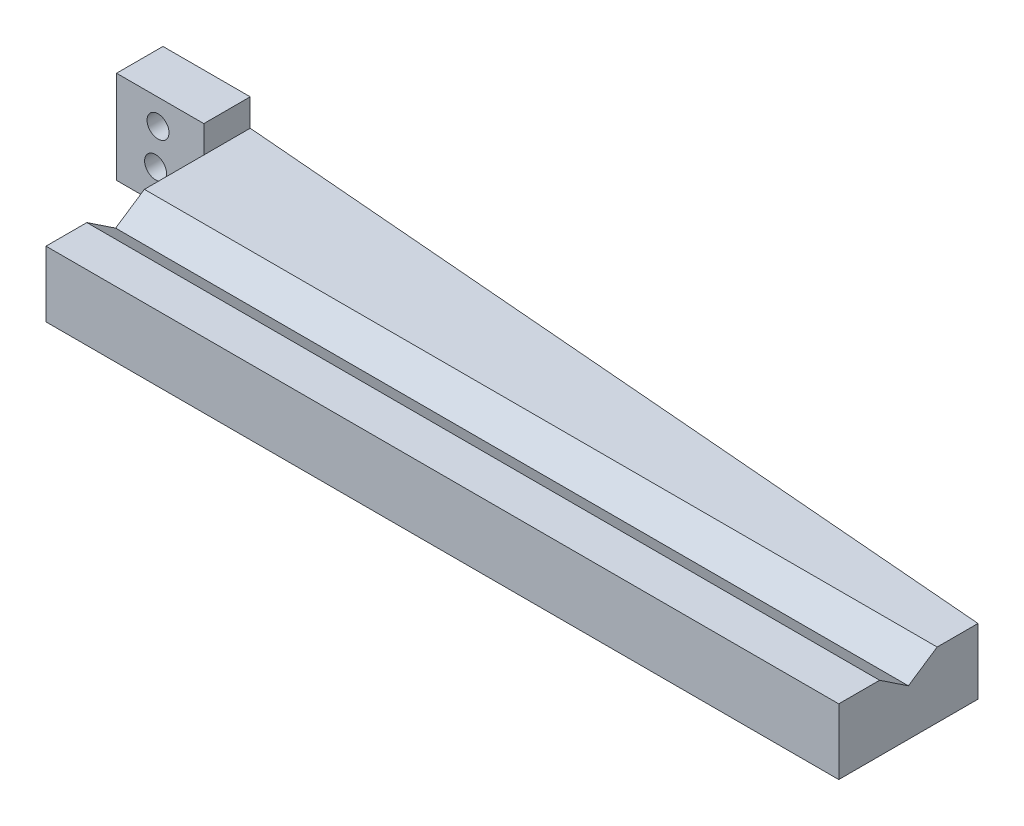
ISO-10303-21;
HEADER;
FILE_DESCRIPTION(('STEP AP214'),'2;1');
FILE_NAME('part.step','',(''),(''),'','','');
FILE_SCHEMA(('AUTOMOTIVE_DESIGN { 1 0 10303 214 1 1 1 1 }'));
ENDSEC;
DATA;
#1=APPLICATION_CONTEXT('core data for automotive mechanical design processes');
#2=APPLICATION_PROTOCOL_DEFINITION('international standard','automotive_design',2000,#1);
#3=PRODUCT_CONTEXT('',#1,'mechanical');
#4=PRODUCT('Part','Part','',(#3));
#5=PRODUCT_RELATED_PRODUCT_CATEGORY('part','',(#4));
#6=PRODUCT_DEFINITION_FORMATION('','',#4);
#7=PRODUCT_DEFINITION_CONTEXT('part definition',#1,'design');
#8=PRODUCT_DEFINITION('design','',#6,#7);
#9=PRODUCT_DEFINITION_SHAPE('','',#8);
#10=(LENGTH_UNIT() NAMED_UNIT(*) SI_UNIT(.MILLI.,.METRE.));
#11=(NAMED_UNIT(*) PLANE_ANGLE_UNIT() SI_UNIT($,.RADIAN.));
#12=(NAMED_UNIT(*) SI_UNIT($,.STERADIAN.) SOLID_ANGLE_UNIT());
#13=UNCERTAINTY_MEASURE_WITH_UNIT(LENGTH_MEASURE(1.E-05),#10,'distance_accuracy_value','');
#14=(GEOMETRIC_REPRESENTATION_CONTEXT(3) GLOBAL_UNCERTAINTY_ASSIGNED_CONTEXT((#13)) GLOBAL_UNIT_ASSIGNED_CONTEXT((#10,
#11,#12)) REPRESENTATION_CONTEXT('',''));
#15=CARTESIAN_POINT('',(0.,0.,0.));
#16=DIRECTION('',(0.,0.,1.));
#17=DIRECTION('',(1.,0.,0.));
#18=AXIS2_PLACEMENT_3D('',#15,#16,#17);
#19=CARTESIAN_POINT('',(0.,6.35,0.));
#20=DIRECTION('',(-1.,0.,0.));
#21=DIRECTION('',(0.,0.,1.));
#22=AXIS2_PLACEMENT_3D('',#19,#20,#21);
#23=PLANE('',#22);
#24=DIRECTION('',(0.,1.,0.));
#25=VECTOR('',#24,1.);
#26=CARTESIAN_POINT('',(0.,12.7,-19.05));
#27=LINE('',#26,#25);
#28=CARTESIAN_POINT('',(0.,0.,-19.05));
#29=VERTEX_POINT('',#28);
#30=CARTESIAN_POINT('',(0.,8.97465996451613,-19.05));
#31=VERTEX_POINT('',#30);
#32=EDGE_CURVE('E131',#29,#31,#27,.T.);
#33=ORIENTED_EDGE('',*,*,#32,.T.);
#34=DIRECTION('',(0.,0.,1.));
#35=VECTOR('',#34,1.);
#36=CARTESIAN_POINT('',(0.,8.97465996451614,0.));
#37=LINE('',#36,#35);
#38=CARTESIAN_POINT('',(0.,8.97465996451619,-13.462));
#39=VERTEX_POINT('',#38);
#40=EDGE_CURVE('E180',#31,#39,#37,.T.);
#41=ORIENTED_EDGE('',*,*,#40,.T.);
#42=DIRECTION('',(0.,-0.554699215611407,0.832050948079557));
#43=VECTOR('',#42,1.);
#44=CARTESIAN_POINT('',(0.,1.12257040558346E-05,7.48378358891833E-06));
#45=LINE('',#44,#43);
#46=CARTESIAN_POINT('',(0.,6.35,-9.52499999999991));
#47=VERTEX_POINT('',#46);
#48=EDGE_CURVE('E185',#39,#47,#45,.T.);
#49=ORIENTED_EDGE('',*,*,#48,.T.);
#50=DIRECTION('',(0.,0.554699215611407,0.832050948079557));
#51=VECTOR('',#50,1.);
#52=CARTESIAN_POINT('',(0.,8.79231028283709,-5.86152522097183));
#53=LINE('',#52,#51);
#54=CARTESIAN_POINT('',(0.,8.97465996451614,-5.58799999999991));
#55=VERTEX_POINT('',#54);
#56=EDGE_CURVE('E189',#47,#55,#53,.T.);
#57=ORIENTED_EDGE('',*,*,#56,.T.);
#58=DIRECTION('',(0.,0.,-1.));
#59=VECTOR('',#58,1.);
#60=CARTESIAN_POINT('',(0.,8.97465996451614,0.));
#61=LINE('',#60,#59);
#62=CARTESIAN_POINT('',(0.,8.97465996451614,0.));
#63=VERTEX_POINT('',#62);
#64=EDGE_CURVE('E193',#63,#55,#61,.T.);
#65=ORIENTED_EDGE('',*,*,#64,.F.);
#66=DIRECTION('',(0.,-1.,0.));
#67=VECTOR('',#66,1.);
#68=CARTESIAN_POINT('',(0.,6.35,0.));
#69=LINE('',#68,#67);
#70=CARTESIAN_POINT('',(0.,0.,0.));
#71=VERTEX_POINT('',#70);
#72=EDGE_CURVE('E11',#63,#71,#69,.T.);
#73=ORIENTED_EDGE('',*,*,#72,.T.);
#74=DIRECTION('',(0.,0.,-1.));
#75=VECTOR('',#74,1.);
#76=CARTESIAN_POINT('',(0.,0.,0.));
#77=LINE('',#76,#75);
#78=EDGE_CURVE('E216',#71,#29,#77,.T.);
#79=ORIENTED_EDGE('',*,*,#78,.T.);
#80=EDGE_LOOP('',(#33,#41,#49,#57,#65,#73,#79));
#81=FACE_BOUND('',#80,.T.);
#82=ADVANCED_FACE('F38',(#81),#23,.F.);
#83=CARTESIAN_POINT('',(-108.458,6.35,-19.05));
#84=DIRECTION('',(1.,0.,0.));
#85=DIRECTION('',(0.,0.,-1.));
#86=AXIS2_PLACEMENT_3D('',#83,#84,#85);
#87=PLANE('',#86);
#88=DIRECTION('',(0.,0.,-1.));
#89=VECTOR('',#88,1.);
#90=CARTESIAN_POINT('',(-108.458,8.97465996451614,0.));
#91=LINE('',#90,#89);
#92=CARTESIAN_POINT('',(-108.458,8.97465996451614,-13.4619999999999));
#93=VERTEX_POINT('',#92);
#94=CARTESIAN_POINT('',(-108.458,8.97465996451613,-21.59));
#95=VERTEX_POINT('',#94);
#96=EDGE_CURVE('E176',#93,#95,#91,.T.);
#97=ORIENTED_EDGE('',*,*,#96,.T.);
#98=DIRECTION('',(0.,-1.,0.));
#99=VECTOR('',#98,1.);
#100=CARTESIAN_POINT('',(-108.458,133.621589231799,-21.59));
#101=LINE('',#100,#99);
#102=CARTESIAN_POINT('',(-108.458,0.,-21.59));
#103=VERTEX_POINT('',#102);
#104=EDGE_CURVE('E168',#95,#103,#101,.T.);
#105=ORIENTED_EDGE('',*,*,#104,.T.);
#106=DIRECTION('',(0.,0.,1.));
#107=VECTOR('',#106,1.);
#108=CARTESIAN_POINT('',(-108.458,0.,-19.05));
#109=LINE('',#108,#107);
#110=CARTESIAN_POINT('',(-108.458,0.,0.));
#111=VERTEX_POINT('',#110);
#112=EDGE_CURVE('E219',#103,#111,#109,.T.);
#113=ORIENTED_EDGE('',*,*,#112,.T.);
#114=DIRECTION('',(0.,-1.,0.));
#115=VECTOR('',#114,1.);
#116=CARTESIAN_POINT('',(-108.458,6.35,0.));
#117=LINE('',#116,#115);
#118=CARTESIAN_POINT('',(-108.458,8.97465996451614,0.));
#119=VERTEX_POINT('',#118);
#120=EDGE_CURVE('E47',#119,#111,#117,.T.);
#121=ORIENTED_EDGE('',*,*,#120,.F.);
#122=DIRECTION('',(0.,0.,1.));
#123=VECTOR('',#122,1.);
#124=CARTESIAN_POINT('',(-108.458,8.97465996451614,0.));
#125=LINE('',#124,#123);
#126=CARTESIAN_POINT('',(-108.458,8.97465996451614,-5.58799999999999));
#127=VERTEX_POINT('',#126);
#128=EDGE_CURVE('E188',#127,#119,#125,.T.);
#129=ORIENTED_EDGE('',*,*,#128,.F.);
#130=DIRECTION('',(0.,-0.554699215611407,-0.832050948079557));
#131=VECTOR('',#130,1.);
#132=CARTESIAN_POINT('',(-108.458,8.79231028283709,-5.86152522097191));
#133=LINE('',#132,#131);
#134=CARTESIAN_POINT('',(-108.458,6.35,-9.52499999999999));
#135=VERTEX_POINT('',#134);
#136=EDGE_CURVE('E197',#127,#135,#133,.T.);
#137=ORIENTED_EDGE('',*,*,#136,.T.);
#138=DIRECTION('',(0.,0.554699215611407,-0.832050948079557));
#139=VECTOR('',#138,1.);
#140=CARTESIAN_POINT('',(-108.458,1.12257040591566E-05,7.48378350492456E-06));
#141=LINE('',#140,#139);
#142=EDGE_CURVE('E177',#135,#93,#141,.T.);
#143=ORIENTED_EDGE('',*,*,#142,.T.);
#144=EDGE_LOOP('',(#97,#105,#113,#121,#129,#137,#143));
#145=FACE_BOUND('',#144,.T.);
#146=ADVANCED_FACE('F225',(#145),#87,.F.);
#147=CARTESIAN_POINT('',(-108.458,133.621589231799,-27.94));
#148=DIRECTION('',(0.0816932394452719,0.,-0.996657521232312));
#149=DIRECTION('',(-0.996657521232313,0.,-0.081693239445272));
#150=AXIS2_PLACEMENT_3D('',#147,#148,#149);
#151=PLANE('',#150);
#152=DIRECTION('',(0.,-1.,0.));
#153=VECTOR('',#152,1.);
#154=CARTESIAN_POINT('',(-108.458,133.621589231799,-27.94));
#155=LINE('',#154,#153);
#156=CARTESIAN_POINT('',(-108.458,8.97465996451613,-27.94));
#157=VERTEX_POINT('',#156);
#158=CARTESIAN_POINT('',(-108.458,0.,-27.94));
#159=VERTEX_POINT('',#158);
#160=EDGE_CURVE('E132',#157,#159,#155,.T.);
#161=ORIENTED_EDGE('',*,*,#160,.F.);
#162=DIRECTION('',(0.996657521232313,0.,0.081693239445272));
#163=VECTOR('',#162,1.);
#164=CARTESIAN_POINT('',(0.,8.97465996451613,-19.05));
#165=LINE('',#164,#163);
#166=EDGE_CURVE('E142',#157,#31,#165,.T.);
#167=ORIENTED_EDGE('',*,*,#166,.T.);
#168=ORIENTED_EDGE('',*,*,#32,.F.);
#169=DIRECTION('',(0.996657521232313,0.,0.081693239445272));
#170=VECTOR('',#169,1.);
#171=CARTESIAN_POINT('',(-108.458,0.,-27.94));
#172=LINE('',#171,#170);
#173=EDGE_CURVE('E257',#159,#29,#172,.T.);
#174=ORIENTED_EDGE('',*,*,#173,.F.);
#175=EDGE_LOOP('',(#161,#167,#168,#174));
#176=FACE_BOUND('',#175,.T.);
#177=ADVANCED_FACE('F293',(#176),#151,.T.);
#178=CARTESIAN_POINT('',(-108.458,6.35,0.));
#179=DIRECTION('',(0.,0.,-1.));
#180=DIRECTION('',(-1.,0.,0.));
#181=AXIS2_PLACEMENT_3D('',#178,#179,#180);
#182=PLANE('',#181);
#183=ORIENTED_EDGE('',*,*,#120,.T.);
#184=DIRECTION('',(1.,0.,0.));
#185=VECTOR('',#184,1.);
#186=CARTESIAN_POINT('',(-108.458,0.,0.));
#187=LINE('',#186,#185);
#188=EDGE_CURVE('E192',#111,#71,#187,.T.);
#189=ORIENTED_EDGE('',*,*,#188,.T.);
#190=ORIENTED_EDGE('',*,*,#72,.F.);
#191=DIRECTION('',(-1.,0.,0.));
#192=VECTOR('',#191,1.);
#193=CARTESIAN_POINT('',(9.88000328589692,8.97465996451614,0.));
#194=LINE('',#193,#192);
#195=EDGE_CURVE('E201',#63,#119,#194,.T.);
#196=ORIENTED_EDGE('',*,*,#195,.T.);
#197=EDGE_LOOP('',(#183,#189,#190,#196));
#198=FACE_BOUND('',#197,.T.);
#199=ADVANCED_FACE('F40',(#198),#182,.F.);
#200=CARTESIAN_POINT('',(0.,0.,0.));
#201=DIRECTION('',(0.,1.,0.));
#202=DIRECTION('',(0.,0.,1.));
#203=AXIS2_PLACEMENT_3D('',#200,#201,#202);
#204=PLANE('',#203);
#205=ORIENTED_EDGE('',*,*,#112,.F.);
#206=DIRECTION('',(-1.,0.,0.));
#207=VECTOR('',#206,1.);
#208=CARTESIAN_POINT('',(-120.396,0.,-21.59));
#209=LINE('',#208,#207);
#210=CARTESIAN_POINT('',(-120.396,0.,-21.59));
#211=VERTEX_POINT('',#210);
#212=EDGE_CURVE('E156',#103,#211,#209,.T.);
#213=ORIENTED_EDGE('',*,*,#212,.T.);
#214=DIRECTION('',(0.,0.,-1.));
#215=VECTOR('',#214,1.);
#216=CARTESIAN_POINT('',(-120.396,0.,-27.94));
#217=LINE('',#216,#215);
#218=CARTESIAN_POINT('',(-120.396,0.,-27.94));
#219=VERTEX_POINT('',#218);
#220=EDGE_CURVE('E264',#211,#219,#217,.T.);
#221=ORIENTED_EDGE('',*,*,#220,.T.);
#222=DIRECTION('',(1.,0.,0.));
#223=VECTOR('',#222,1.);
#224=CARTESIAN_POINT('',(-108.458,0.,-27.94));
#225=LINE('',#224,#223);
#226=EDGE_CURVE('E259',#219,#159,#225,.T.);
#227=ORIENTED_EDGE('',*,*,#226,.T.);
#228=ORIENTED_EDGE('',*,*,#173,.T.);
#229=ORIENTED_EDGE('',*,*,#78,.F.);
#230=ORIENTED_EDGE('',*,*,#188,.F.);
#231=EDGE_LOOP('',(#205,#213,#221,#227,#228,#229,#230));
#232=FACE_BOUND('',#231,.T.);
#233=ADVANCED_FACE('F231',(#232),#204,.F.);
#234=CARTESIAN_POINT('',(9.88000328589692,8.97465996451614,0.));
#235=DIRECTION('',(0.,-1.,0.));
#236=DIRECTION('',(0.,0.,-1.));
#237=AXIS2_PLACEMENT_3D('',#234,#235,#236);
#238=PLANE('',#237);
#239=ORIENTED_EDGE('',*,*,#195,.F.);
#240=ORIENTED_EDGE('',*,*,#64,.T.);
#241=DIRECTION('',(-1.,0.,0.));
#242=VECTOR('',#241,1.);
#243=CARTESIAN_POINT('',(9.88000328589692,8.97465996451614,-5.58799999999991));
#244=LINE('',#243,#242);
#245=EDGE_CURVE('E206',#55,#127,#244,.T.);
#246=ORIENTED_EDGE('',*,*,#245,.T.);
#247=ORIENTED_EDGE('',*,*,#128,.T.);
#248=EDGE_LOOP('',(#239,#240,#246,#247));
#249=FACE_BOUND('',#248,.T.);
#250=ADVANCED_FACE('F237',(#249),#238,.F.);
#251=CARTESIAN_POINT('',(9.88000328589692,8.79231028283709,-5.86152522097182));
#252=DIRECTION('',(0.,0.832050948079557,-0.554699215611407));
#253=DIRECTION('',(0.,0.554699215611407,0.832050948079557));
#254=AXIS2_PLACEMENT_3D('',#251,#252,#253);
#255=PLANE('',#254);
#256=ORIENTED_EDGE('',*,*,#56,.F.);
#257=DIRECTION('',(-1.,0.,0.));
#258=VECTOR('',#257,1.);
#259=CARTESIAN_POINT('',(9.88000328589693,6.35,-9.52499999999991));
#260=LINE('',#259,#258);
#261=EDGE_CURVE('E202',#47,#135,#260,.T.);
#262=ORIENTED_EDGE('',*,*,#261,.T.);
#263=ORIENTED_EDGE('',*,*,#136,.F.);
#264=ORIENTED_EDGE('',*,*,#245,.F.);
#265=EDGE_LOOP('',(#256,#262,#263,#264));
#266=FACE_BOUND('',#265,.T.);
#267=ADVANCED_FACE('F240',(#266),#255,.T.);
#268=CARTESIAN_POINT('',(9.88000328589692,8.97465996451614,0.));
#269=DIRECTION('',(0.,1.,0.));
#270=DIRECTION('',(0.,0.,1.));
#271=AXIS2_PLACEMENT_3D('',#268,#269,#270);
#272=PLANE('',#271);
#273=ORIENTED_EDGE('',*,*,#40,.F.);
#274=ORIENTED_EDGE('',*,*,#166,.F.);
#275=DIRECTION('',(0.,0.,-1.));
#276=VECTOR('',#275,1.);
#277=CARTESIAN_POINT('',(-108.458,8.97465996451613,-27.94));
#278=LINE('',#277,#276);
#279=EDGE_CURVE('E126',#95,#157,#278,.T.);
#280=ORIENTED_EDGE('',*,*,#279,.F.);
#281=ORIENTED_EDGE('',*,*,#96,.F.);
#282=DIRECTION('',(-1.,0.,0.));
#283=VECTOR('',#282,1.);
#284=CARTESIAN_POINT('',(9.88000328589693,8.97465996451614,-13.4619999999999));
#285=LINE('',#284,#283);
#286=EDGE_CURVE('E172',#39,#93,#285,.T.);
#287=ORIENTED_EDGE('',*,*,#286,.F.);
#288=EDGE_LOOP('',(#273,#274,#280,#281,#287));
#289=FACE_BOUND('',#288,.T.);
#290=ADVANCED_FACE('F249',(#289),#272,.T.);
#291=CARTESIAN_POINT('',(9.88000328589692,1.12257040591566E-05,7.48378359113294E-06));
#292=DIRECTION('',(0.,0.832050948079557,0.554699215611407));
#293=DIRECTION('',(0.,-0.554699215611407,0.832050948079557));
#294=AXIS2_PLACEMENT_3D('',#291,#292,#293);
#295=PLANE('',#294);
#296=ORIENTED_EDGE('',*,*,#48,.F.);
#297=ORIENTED_EDGE('',*,*,#286,.T.);
#298=ORIENTED_EDGE('',*,*,#142,.F.);
#299=ORIENTED_EDGE('',*,*,#261,.F.);
#300=EDGE_LOOP('',(#296,#297,#298,#299));
#301=FACE_BOUND('',#300,.T.);
#302=ADVANCED_FACE('F244',(#301),#295,.T.);
#303=CARTESIAN_POINT('',(-108.458,12.7,0.));
#304=DIRECTION('',(0.,1.,0.));
#305=DIRECTION('',(0.,0.,1.));
#306=AXIS2_PLACEMENT_3D('',#303,#304,#305);
#307=PLANE('',#306);
#308=DIRECTION('',(0.,0.,1.));
#309=VECTOR('',#308,1.);
#310=CARTESIAN_POINT('',(-108.458,12.7,-27.94));
#311=LINE('',#310,#309);
#312=CARTESIAN_POINT('',(-108.458,12.7,-27.94));
#313=VERTEX_POINT('',#312);
#314=CARTESIAN_POINT('',(-108.458,12.7,-21.59));
#315=VERTEX_POINT('',#314);
#316=EDGE_CURVE('E123',#313,#315,#311,.T.);
#317=ORIENTED_EDGE('',*,*,#316,.F.);
#318=DIRECTION('',(1.,0.,0.));
#319=VECTOR('',#318,1.);
#320=CARTESIAN_POINT('',(-108.458,12.7,-27.94));
#321=LINE('',#320,#319);
#322=CARTESIAN_POINT('',(-120.396,12.7,-27.94));
#323=VERTEX_POINT('',#322);
#324=EDGE_CURVE('E136',#323,#313,#321,.T.);
#325=ORIENTED_EDGE('',*,*,#324,.F.);
#326=DIRECTION('',(0.,0.,-1.));
#327=VECTOR('',#326,1.);
#328=CARTESIAN_POINT('',(-120.396,12.7,-27.94));
#329=LINE('',#328,#327);
#330=CARTESIAN_POINT('',(-120.396,12.7,-21.59));
#331=VERTEX_POINT('',#330);
#332=EDGE_CURVE('E152',#331,#323,#329,.T.);
#333=ORIENTED_EDGE('',*,*,#332,.F.);
#334=DIRECTION('',(-1.,0.,0.));
#335=VECTOR('',#334,1.);
#336=CARTESIAN_POINT('',(-120.396,12.7,-21.59));
#337=LINE('',#336,#335);
#338=EDGE_CURVE('E139',#315,#331,#337,.T.);
#339=ORIENTED_EDGE('',*,*,#338,.F.);
#340=EDGE_LOOP('',(#317,#325,#333,#339));
#341=FACE_BOUND('',#340,.T.);
#342=ADVANCED_FACE('F135',(#341),#307,.T.);
#343=CARTESIAN_POINT('',(-120.396,133.621589231799,-21.59));
#344=DIRECTION('',(0.,0.,1.));
#345=DIRECTION('',(1.,0.,0.));
#346=AXIS2_PLACEMENT_3D('',#343,#344,#345);
#347=PLANE('',#346);
#348=CARTESIAN_POINT('',(-114.72155051271,9.23479964939844,-21.59));
#349=DIRECTION('',(0.,0.,1.));
#350=DIRECTION('',(1.,0.,0.));
#351=AXIS2_PLACEMENT_3D('',#348,#349,#350);
#352=CIRCLE('',#351,1.5);
#353=CARTESIAN_POINT('',(-113.22155051271,9.23479964939844,-21.59));
#354=VERTEX_POINT('',#353);
#355=EDGE_CURVE('E267',#354,#354,#352,.T.);
#356=ORIENTED_EDGE('',*,*,#355,.F.);
#357=EDGE_LOOP('',(#356));
#358=FACE_BOUND('',#357,.T.);
#359=CARTESIAN_POINT('',(-115.057652976821,4.23728899252751,-21.59));
#360=DIRECTION('',(0.,0.,1.));
#361=DIRECTION('',(1.,0.,0.));
#362=AXIS2_PLACEMENT_3D('',#359,#360,#361);
#363=CIRCLE('',#362,1.5);
#364=CARTESIAN_POINT('',(-113.557652976821,4.23728899252751,-21.59));
#365=VERTEX_POINT('',#364);
#366=EDGE_CURVE('E275',#365,#365,#363,.T.);
#367=ORIENTED_EDGE('',*,*,#366,.F.);
#368=EDGE_LOOP('',(#367));
#369=FACE_BOUND('',#368,.T.);
#370=EDGE_CURVE('E162',#315,#95,#101,.T.);
#371=ORIENTED_EDGE('',*,*,#370,.F.);
#372=ORIENTED_EDGE('',*,*,#338,.T.);
#373=DIRECTION('',(0.,-1.,0.));
#374=VECTOR('',#373,1.);
#375=CARTESIAN_POINT('',(-120.396,133.621589231799,-21.59));
#376=LINE('',#375,#374);
#377=EDGE_CURVE('E160',#331,#211,#376,.T.);
#378=ORIENTED_EDGE('',*,*,#377,.T.);
#379=ORIENTED_EDGE('',*,*,#212,.F.);
#380=ORIENTED_EDGE('',*,*,#104,.F.);
#381=EDGE_LOOP('',(#371,#372,#378,#379,#380));
#382=FACE_BOUND('',#381,.T.);
#383=ADVANCED_FACE('F255',(#358,#369,#382),#347,.T.);
#384=CARTESIAN_POINT('',(-120.396,133.621589231799,-27.94));
#385=DIRECTION('',(-1.,0.,0.));
#386=DIRECTION('',(0.,0.,1.));
#387=AXIS2_PLACEMENT_3D('',#384,#385,#386);
#388=PLANE('',#387);
#389=ORIENTED_EDGE('',*,*,#377,.F.);
#390=ORIENTED_EDGE('',*,*,#332,.T.);
#391=DIRECTION('',(0.,-1.,0.));
#392=VECTOR('',#391,1.);
#393=CARTESIAN_POINT('',(-120.396,133.621589231799,-27.94));
#394=LINE('',#393,#392);
#395=EDGE_CURVE('E146',#323,#219,#394,.T.);
#396=ORIENTED_EDGE('',*,*,#395,.T.);
#397=ORIENTED_EDGE('',*,*,#220,.F.);
#398=EDGE_LOOP('',(#389,#390,#396,#397));
#399=FACE_BOUND('',#398,.T.);
#400=ADVANCED_FACE('F322',(#399),#388,.T.);
#401=CARTESIAN_POINT('',(-108.458,133.621589231799,-27.94));
#402=DIRECTION('',(0.,0.,-1.));
#403=DIRECTION('',(-1.,0.,0.));
#404=AXIS2_PLACEMENT_3D('',#401,#402,#403);
#405=PLANE('',#404);
#406=CARTESIAN_POINT('',(-114.72155051271,9.23479964939844,-27.94));
#407=DIRECTION('',(0.,0.,-1.));
#408=DIRECTION('',(-1.,0.,0.));
#409=AXIS2_PLACEMENT_3D('',#406,#407,#408);
#410=CIRCLE('',#409,1.5);
#411=CARTESIAN_POINT('',(-116.22155051271,9.23479964939844,-27.94));
#412=VERTEX_POINT('',#411);
#413=EDGE_CURVE('E280',#412,#412,#410,.T.);
#414=ORIENTED_EDGE('',*,*,#413,.F.);
#415=EDGE_LOOP('',(#414));
#416=FACE_BOUND('',#415,.T.);
#417=CARTESIAN_POINT('',(-115.057652976821,4.23728899252751,-27.94));
#418=DIRECTION('',(0.,0.,-1.));
#419=DIRECTION('',(-1.,0.,0.));
#420=AXIS2_PLACEMENT_3D('',#417,#418,#419);
#421=CIRCLE('',#420,1.5);
#422=CARTESIAN_POINT('',(-116.557652976821,4.23728899252751,-27.94));
#423=VERTEX_POINT('',#422);
#424=EDGE_CURVE('E253',#423,#423,#421,.T.);
#425=ORIENTED_EDGE('',*,*,#424,.F.);
#426=EDGE_LOOP('',(#425));
#427=FACE_BOUND('',#426,.T.);
#428=ORIENTED_EDGE('',*,*,#395,.F.);
#429=ORIENTED_EDGE('',*,*,#324,.T.);
#430=EDGE_CURVE('E119',#313,#157,#155,.T.);
#431=ORIENTED_EDGE('',*,*,#430,.T.);
#432=ORIENTED_EDGE('',*,*,#160,.T.);
#433=ORIENTED_EDGE('',*,*,#226,.F.);
#434=EDGE_LOOP('',(#428,#429,#431,#432,#433));
#435=FACE_BOUND('',#434,.T.);
#436=ADVANCED_FACE('F144',(#416,#427,#435),#405,.T.);
#437=CARTESIAN_POINT('',(-115.057652976821,4.23728899252751,5.07999999999996));
#438=DIRECTION('',(0.,0.,-1.));
#439=DIRECTION('',(-1.,0.,0.));
#440=AXIS2_PLACEMENT_3D('',#437,#438,#439);
#441=CYLINDRICAL_SURFACE('',#440,1.5);
#442=ORIENTED_EDGE('',*,*,#366,.T.);
#443=EDGE_LOOP('',(#442));
#444=FACE_BOUND('',#443,.T.);
#445=ORIENTED_EDGE('',*,*,#424,.T.);
#446=EDGE_LOOP('',(#445));
#447=FACE_BOUND('',#446,.T.);
#448=ADVANCED_FACE('F327',(#444,#447),#441,.F.);
#449=CARTESIAN_POINT('',(-114.72155051271,9.23479964939844,5.07999999999996));
#450=DIRECTION('',(0.,0.,-1.));
#451=DIRECTION('',(-1.,0.,0.));
#452=AXIS2_PLACEMENT_3D('',#449,#450,#451);
#453=CYLINDRICAL_SURFACE('',#452,1.5);
#454=ORIENTED_EDGE('',*,*,#355,.T.);
#455=EDGE_LOOP('',(#454));
#456=FACE_BOUND('',#455,.T.);
#457=ORIENTED_EDGE('',*,*,#413,.T.);
#458=EDGE_LOOP('',(#457));
#459=FACE_BOUND('',#458,.T.);
#460=ADVANCED_FACE('F333',(#456,#459),#453,.F.);
#461=CARTESIAN_POINT('',(-108.458,-100.066486812029,-27.94));
#462=DIRECTION('',(-1.,0.,0.));
#463=DIRECTION('',(0.,0.,1.));
#464=AXIS2_PLACEMENT_3D('',#461,#462,#463);
#465=PLANE('',#464);
#466=ORIENTED_EDGE('',*,*,#370,.T.);
#467=ORIENTED_EDGE('',*,*,#279,.T.);
#468=ORIENTED_EDGE('',*,*,#430,.F.);
#469=ORIENTED_EDGE('',*,*,#316,.T.);
#470=EDGE_LOOP('',(#466,#467,#468,#469));
#471=FACE_BOUND('',#470,.T.);
#472=ADVANCED_FACE('F122',(#471),#465,.F.);
#473=CLOSED_SHELL('',(#82,#146,#177,#199,#233,#250,#267,#290,#302,#342,#383,#400,#436,#448,#460,#472));
#474=MANIFOLD_SOLID_BREP('B2',#473);
#475=ADVANCED_BREP_SHAPE_REPRESENTATION('',(#18,#474),#14);
#476=SHAPE_DEFINITION_REPRESENTATION(#9,#475);
ENDSEC;
END-ISO-10303-21;
